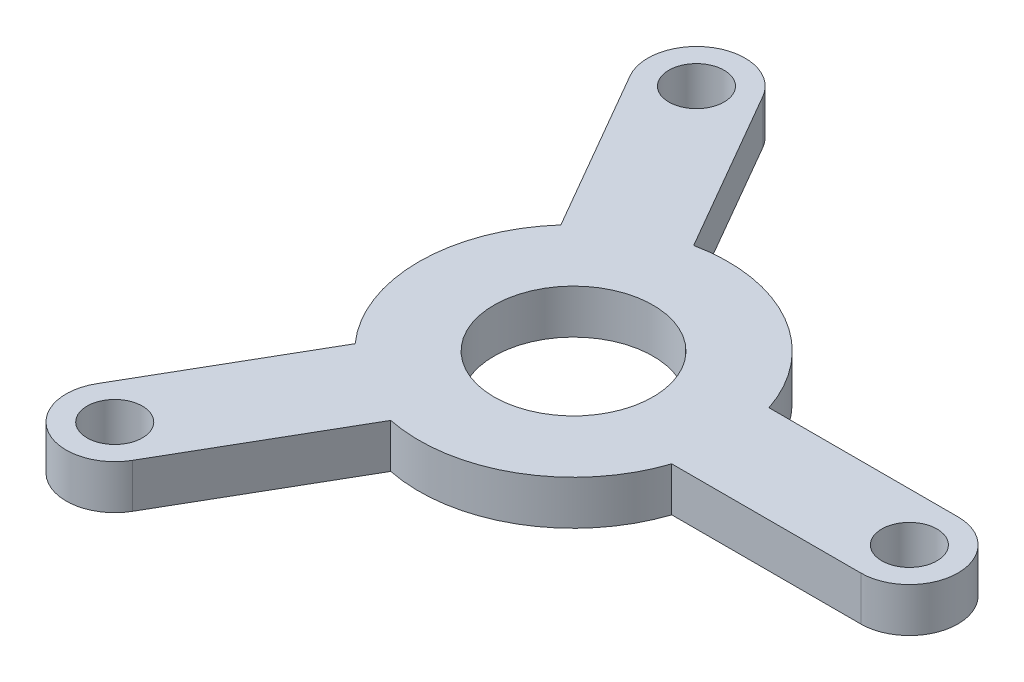
ISO-10303-21;
HEADER;
FILE_DESCRIPTION(('STEP AP214'),'2;1');
FILE_NAME('part.step','',(''),(''),'','','');
FILE_SCHEMA(('AUTOMOTIVE_DESIGN { 1 0 10303 214 1 1 1 1 }'));
ENDSEC;
DATA;
#1=APPLICATION_CONTEXT('core data for automotive mechanical design processes');
#2=APPLICATION_PROTOCOL_DEFINITION('international standard','automotive_design',2000,#1);
#3=PRODUCT_CONTEXT('',#1,'mechanical');
#4=PRODUCT('Part','Part','',(#3));
#5=PRODUCT_RELATED_PRODUCT_CATEGORY('part','',(#4));
#6=PRODUCT_DEFINITION_FORMATION('','',#4);
#7=PRODUCT_DEFINITION_CONTEXT('part definition',#1,'design');
#8=PRODUCT_DEFINITION('design','',#6,#7);
#9=PRODUCT_DEFINITION_SHAPE('','',#8);
#10=(LENGTH_UNIT() NAMED_UNIT(*) SI_UNIT(.MILLI.,.METRE.));
#11=(NAMED_UNIT(*) PLANE_ANGLE_UNIT() SI_UNIT($,.RADIAN.));
#12=(NAMED_UNIT(*) SI_UNIT($,.STERADIAN.) SOLID_ANGLE_UNIT());
#13=UNCERTAINTY_MEASURE_WITH_UNIT(LENGTH_MEASURE(1.E-05),#10,'distance_accuracy_value','');
#14=(GEOMETRIC_REPRESENTATION_CONTEXT(3) GLOBAL_UNCERTAINTY_ASSIGNED_CONTEXT((#13)) GLOBAL_UNIT_ASSIGNED_CONTEXT((#10,
#11,#12)) REPRESENTATION_CONTEXT('',''));
#15=CARTESIAN_POINT('',(0.,0.,0.));
#16=DIRECTION('',(0.,0.,1.));
#17=DIRECTION('',(1.,0.,0.));
#18=AXIS2_PLACEMENT_3D('',#15,#16,#17);
#19=CARTESIAN_POINT('',(0.,5.,0.));
#20=DIRECTION('',(0.,-1.,0.));
#21=DIRECTION('',(0.,0.,-1.));
#22=AXIS2_PLACEMENT_3D('',#19,#20,#21);
#23=CYLINDRICAL_SURFACE('',#22,17.5);
#24=DIRECTION('',(0.,-1.,0.));
#25=VECTOR('',#24,1.);
#26=CARTESIAN_POINT('',(-13.0697635837324,5.,11.6374945699383));
#27=LINE('',#26,#25);
#28=CARTESIAN_POINT('',(-13.0697635837324,5.,11.6374945699383));
#29=VERTEX_POINT('',#28);
#30=CARTESIAN_POINT('',(-13.0697635837324,0.,11.6374945699383));
#31=VERTEX_POINT('',#30);
#32=EDGE_CURVE('E158',#29,#31,#27,.T.);
#33=ORIENTED_EDGE('',*,*,#32,.F.);
#34=CARTESIAN_POINT('',(0.,5.,0.));
#35=DIRECTION('',(0.,1.,0.));
#36=DIRECTION('',(0.,0.,1.));
#37=AXIS2_PLACEMENT_3D('',#34,#35,#36);
#38=CIRCLE('',#37,17.5);
#39=CARTESIAN_POINT('',(-13.0697635837325,5.,-11.6374945699381));
#40=VERTEX_POINT('',#39);
#41=EDGE_CURVE('E129',#40,#29,#38,.T.);
#42=ORIENTED_EDGE('',*,*,#41,.F.);
#43=DIRECTION('',(0.,-1.,0.));
#44=VECTOR('',#43,1.);
#45=CARTESIAN_POINT('',(-13.0697635837325,5.,-11.6374945699381));
#46=LINE('',#45,#44);
#47=CARTESIAN_POINT('',(-13.0697635837325,0.,-11.6374945699381));
#48=VERTEX_POINT('',#47);
#49=EDGE_CURVE('E173',#40,#48,#46,.T.);
#50=ORIENTED_EDGE('',*,*,#49,.T.);
#51=CARTESIAN_POINT('',(0.,0.,0.));
#52=DIRECTION('',(0.,1.,0.));
#53=DIRECTION('',(0.,0.,1.));
#54=AXIS2_PLACEMENT_3D('',#51,#52,#53);
#55=CIRCLE('',#54,17.5);
#56=EDGE_CURVE('E222',#48,#31,#55,.T.);
#57=ORIENTED_EDGE('',*,*,#56,.T.);
#58=EDGE_LOOP('',(#33,#42,#50,#57));
#59=FACE_BOUND('',#58,.T.);
#60=ADVANCED_FACE('F37',(#59),#23,.T.);
#61=DIRECTION('',(0.,-1.,0.));
#62=VECTOR('',#61,1.);
#63=CARTESIAN_POINT('',(-3.54348414210373,5.,-17.1374945699381));
#64=LINE('',#63,#62);
#65=CARTESIAN_POINT('',(-3.54348414210373,5.,-17.1374945699381));
#66=VERTEX_POINT('',#65);
#67=CARTESIAN_POINT('',(-3.54348414210374,0.,-17.1374945699382));
#68=VERTEX_POINT('',#67);
#69=EDGE_CURVE('E181',#66,#68,#64,.T.);
#70=ORIENTED_EDGE('',*,*,#69,.F.);
#71=CARTESIAN_POINT('',(16.6132477258362,5.,-5.49999999999999));
#72=VERTEX_POINT('',#71);
#73=EDGE_CURVE('E216',#72,#66,#38,.T.);
#74=ORIENTED_EDGE('',*,*,#73,.F.);
#75=DIRECTION('',(0.,-1.,0.));
#76=VECTOR('',#75,1.);
#77=CARTESIAN_POINT('',(16.6132477258362,5.,-5.49999999999999));
#78=LINE('',#77,#76);
#79=CARTESIAN_POINT('',(16.6132477258362,0.,-5.49999999999999));
#80=VERTEX_POINT('',#79);
#81=EDGE_CURVE('E45',#72,#80,#78,.T.);
#82=ORIENTED_EDGE('',*,*,#81,.T.);
#83=EDGE_CURVE('E220',#80,#68,#55,.T.);
#84=ORIENTED_EDGE('',*,*,#83,.T.);
#85=EDGE_LOOP('',(#70,#74,#82,#84));
#86=FACE_BOUND('',#85,.T.);
#87=ADVANCED_FACE('F229',(#86),#23,.T.);
#88=CARTESIAN_POINT('',(-3.54348414210351,5.,17.1374945699382));
#89=VERTEX_POINT('',#88);
#90=CARTESIAN_POINT('',(16.6132477258361,5.,5.50000000000001));
#91=VERTEX_POINT('',#90);
#92=EDGE_CURVE('E219',#89,#91,#38,.T.);
#93=ORIENTED_EDGE('',*,*,#92,.F.);
#94=DIRECTION('',(0.,-1.,0.));
#95=VECTOR('',#94,1.);
#96=CARTESIAN_POINT('',(-3.54348414210351,5.,17.1374945699382));
#97=LINE('',#96,#95);
#98=CARTESIAN_POINT('',(-3.54348414210351,0.,17.1374945699382));
#99=VERTEX_POINT('',#98);
#100=EDGE_CURVE('E144',#89,#99,#97,.T.);
#101=ORIENTED_EDGE('',*,*,#100,.T.);
#102=CARTESIAN_POINT('',(16.6132477258361,0.,5.50000000000001));
#103=VERTEX_POINT('',#102);
#104=EDGE_CURVE('E213',#99,#103,#55,.T.);
#105=ORIENTED_EDGE('',*,*,#104,.T.);
#106=DIRECTION('',(0.,-1.,0.));
#107=VECTOR('',#106,1.);
#108=CARTESIAN_POINT('',(16.6132477258361,5.,5.50000000000001));
#109=LINE('',#108,#107);
#110=EDGE_CURVE('E11',#91,#103,#109,.T.);
#111=ORIENTED_EDGE('',*,*,#110,.F.);
#112=EDGE_LOOP('',(#93,#101,#105,#111));
#113=FACE_BOUND('',#112,.T.);
#114=ADVANCED_FACE('F39',(#113),#23,.T.);
#115=CARTESIAN_POINT('',(0.,5.,0.));
#116=DIRECTION('',(0.,1.,0.));
#117=DIRECTION('',(0.,0.,1.));
#118=AXIS2_PLACEMENT_3D('',#115,#116,#117);
#119=PLANE('',#118);
#120=CARTESIAN_POINT('',(-19.0000000000002,5.,-32.9089653438086));
#121=DIRECTION('',(0.,1.,0.));
#122=DIRECTION('',(0.,0.,1.));
#123=AXIS2_PLACEMENT_3D('',#120,#121,#122);
#124=CIRCLE('',#123,3.125);
#125=CARTESIAN_POINT('',(-19.0000000000002,5.,-29.7839653438086));
#126=VERTEX_POINT('',#125);
#127=EDGE_CURVE('E152',#126,#126,#124,.T.);
#128=ORIENTED_EDGE('',*,*,#127,.F.);
#129=EDGE_LOOP('',(#128));
#130=FACE_BOUND('',#129,.T.);
#131=CARTESIAN_POINT('',(-18.9999999999997,5.,32.9089653438088));
#132=DIRECTION('',(0.,1.,0.));
#133=DIRECTION('',(0.,0.,1.));
#134=AXIS2_PLACEMENT_3D('',#131,#132,#133);
#135=CIRCLE('',#134,3.125);
#136=CARTESIAN_POINT('',(-18.9999999999997,5.,36.0339653438088));
#137=VERTEX_POINT('',#136);
#138=EDGE_CURVE('E268',#137,#137,#135,.T.);
#139=ORIENTED_EDGE('',*,*,#138,.F.);
#140=EDGE_LOOP('',(#139));
#141=FACE_BOUND('',#140,.T.);
#142=ORIENTED_EDGE('',*,*,#41,.T.);
#143=DIRECTION('',(-0.499999999999992,0.,0.866025403784443));
#144=VECTOR('',#143,1.);
#145=CARTESIAN_POINT('',(-4.76313972081445,5.,-2.74999999999996));
#146=LINE('',#145,#144);
#147=CARTESIAN_POINT('',(-23.7631397208141,5.,30.1589653438089));
#148=VERTEX_POINT('',#147);
#149=EDGE_CURVE('E123',#29,#148,#146,.T.);
#150=ORIENTED_EDGE('',*,*,#149,.T.);
#151=CARTESIAN_POINT('',(-18.9999999999997,5.,32.9089653438088));
#152=DIRECTION('',(0.,1.,0.));
#153=DIRECTION('',(0.,0.,1.));
#154=AXIS2_PLACEMENT_3D('',#151,#152,#153);
#155=CIRCLE('',#154,5.5);
#156=CARTESIAN_POINT('',(-14.2368602791853,5.,35.6589653438088));
#157=VERTEX_POINT('',#156);
#158=EDGE_CURVE('E127',#148,#157,#155,.T.);
#159=ORIENTED_EDGE('',*,*,#158,.T.);
#160=DIRECTION('',(-0.499999999999992,0.,0.866025403784443));
#161=VECTOR('',#160,1.);
#162=CARTESIAN_POINT('',(4.76313972081443,5.,2.74999999999995));
#163=LINE('',#162,#161);
#164=EDGE_CURVE('E52',#89,#157,#163,.T.);
#165=ORIENTED_EDGE('',*,*,#164,.F.);
#166=ORIENTED_EDGE('',*,*,#92,.T.);
#167=DIRECTION('',(1.,0.,0.));
#168=VECTOR('',#167,1.);
#169=CARTESIAN_POINT('',(0.,5.,5.50000000000001));
#170=LINE('',#169,#168);
#171=CARTESIAN_POINT('',(38.,5.,5.5));
#172=VERTEX_POINT('',#171);
#173=EDGE_CURVE('E192',#91,#172,#170,.T.);
#174=ORIENTED_EDGE('',*,*,#173,.T.);
#175=CARTESIAN_POINT('',(38.,5.,0.));
#176=DIRECTION('',(0.,1.,0.));
#177=DIRECTION('',(0.,0.,1.));
#178=AXIS2_PLACEMENT_3D('',#175,#176,#177);
#179=CIRCLE('',#178,5.5);
#180=CARTESIAN_POINT('',(38.,5.,-5.5));
#181=VERTEX_POINT('',#180);
#182=EDGE_CURVE('E201',#172,#181,#179,.T.);
#183=ORIENTED_EDGE('',*,*,#182,.T.);
#184=DIRECTION('',(1.,0.,0.));
#185=VECTOR('',#184,1.);
#186=CARTESIAN_POINT('',(0.,5.,-5.49999999999999));
#187=LINE('',#186,#185);
#188=EDGE_CURVE('E197',#72,#181,#187,.T.);
#189=ORIENTED_EDGE('',*,*,#188,.F.);
#190=ORIENTED_EDGE('',*,*,#73,.T.);
#191=DIRECTION('',(-0.500000000000004,0.,-0.866025403784436));
#192=VECTOR('',#191,1.);
#193=CARTESIAN_POINT('',(4.76313972081441,5.,-2.75000000000003));
#194=LINE('',#193,#192);
#195=CARTESIAN_POINT('',(-14.2368602791858,5.,-35.6589653438086));
#196=VERTEX_POINT('',#195);
#197=EDGE_CURVE('E163',#66,#196,#194,.T.);
#198=ORIENTED_EDGE('',*,*,#197,.T.);
#199=CARTESIAN_POINT('',(-19.0000000000002,5.,-32.9089653438086));
#200=DIRECTION('',(0.,1.,0.));
#201=DIRECTION('',(0.,0.,1.));
#202=AXIS2_PLACEMENT_3D('',#199,#200,#201);
#203=CIRCLE('',#202,5.5);
#204=CARTESIAN_POINT('',(-23.7631397208146,5.,-30.1589653438086));
#205=VERTEX_POINT('',#204);
#206=EDGE_CURVE('E171',#196,#205,#203,.T.);
#207=ORIENTED_EDGE('',*,*,#206,.T.);
#208=DIRECTION('',(-0.500000000000004,0.,-0.866025403784436));
#209=VECTOR('',#208,1.);
#210=CARTESIAN_POINT('',(-4.76313972081439,5.,2.75000000000002));
#211=LINE('',#210,#209);
#212=EDGE_CURVE('E59',#40,#205,#211,.T.);
#213=ORIENTED_EDGE('',*,*,#212,.F.);
#214=EDGE_LOOP('',(#142,#150,#159,#165,#166,#174,#183,#189,#190,#198,#207,#213));
#215=FACE_BOUND('',#214,.T.);
#216=CARTESIAN_POINT('',(38.,5.,0.));
#217=DIRECTION('',(0.,1.,0.));
#218=DIRECTION('',(0.,0.,1.));
#219=AXIS2_PLACEMENT_3D('',#216,#217,#218);
#220=CIRCLE('',#219,3.125);
#221=CARTESIAN_POINT('',(38.,5.,3.125));
#222=VERTEX_POINT('',#221);
#223=EDGE_CURVE('E186',#222,#222,#220,.T.);
#224=ORIENTED_EDGE('',*,*,#223,.F.);
#225=EDGE_LOOP('',(#224));
#226=FACE_BOUND('',#225,.T.);
#227=CARTESIAN_POINT('',(0.,5.,0.));
#228=DIRECTION('',(0.,1.,0.));
#229=DIRECTION('',(0.,0.,1.));
#230=AXIS2_PLACEMENT_3D('',#227,#228,#229);
#231=CIRCLE('',#230,9.);
#232=CARTESIAN_POINT('',(0.,5.,9.));
#233=VERTEX_POINT('',#232);
#234=EDGE_CURVE('E210',#233,#233,#231,.T.);
#235=ORIENTED_EDGE('',*,*,#234,.F.);
#236=EDGE_LOOP('',(#235));
#237=FACE_BOUND('',#236,.T.);
#238=ADVANCED_FACE('F125',(#130,#141,#215,#226,#237),#119,.T.);
#239=CARTESIAN_POINT('',(0.,0.,0.));
#240=DIRECTION('',(0.,1.,0.));
#241=DIRECTION('',(0.,0.,1.));
#242=AXIS2_PLACEMENT_3D('',#239,#240,#241);
#243=PLANE('',#242);
#244=CARTESIAN_POINT('',(-19.0000000000002,0.,-32.9089653438086));
#245=DIRECTION('',(0.,1.,0.));
#246=DIRECTION('',(0.866025403784436,0.,-0.500000000000004));
#247=AXIS2_PLACEMENT_3D('',#244,#245,#246);
#248=CIRCLE('',#247,3.125);
#249=CARTESIAN_POINT('',(-16.2936706131738,0.,-34.4714653438086));
#250=VERTEX_POINT('',#249);
#251=EDGE_CURVE('E271',#250,#250,#248,.T.);
#252=ORIENTED_EDGE('',*,*,#251,.T.);
#253=EDGE_LOOP('',(#252));
#254=FACE_BOUND('',#253,.T.);
#255=CARTESIAN_POINT('',(-18.9999999999997,0.,32.9089653438088));
#256=DIRECTION('',(0.,1.,0.));
#257=DIRECTION('',(-0.866025403784443,0.,-0.499999999999992));
#258=AXIS2_PLACEMENT_3D('',#255,#256,#257);
#259=CIRCLE('',#258,3.125);
#260=CARTESIAN_POINT('',(-21.7063293868261,0.,31.3464653438089));
#261=VERTEX_POINT('',#260);
#262=EDGE_CURVE('E272',#261,#261,#259,.T.);
#263=ORIENTED_EDGE('',*,*,#262,.T.);
#264=EDGE_LOOP('',(#263));
#265=FACE_BOUND('',#264,.T.);
#266=ORIENTED_EDGE('',*,*,#104,.F.);
#267=DIRECTION('',(-0.499999999999992,0.,0.866025403784443));
#268=VECTOR('',#267,1.);
#269=CARTESIAN_POINT('',(4.76313972081443,0.,2.74999999999995));
#270=LINE('',#269,#268);
#271=CARTESIAN_POINT('',(-14.2368602791853,0.,35.6589653438088));
#272=VERTEX_POINT('',#271);
#273=EDGE_CURVE('E133',#99,#272,#270,.T.);
#274=ORIENTED_EDGE('',*,*,#273,.T.);
#275=CARTESIAN_POINT('',(-18.9999999999997,0.,32.9089653438088));
#276=DIRECTION('',(0.,1.,0.));
#277=DIRECTION('',(-0.866025403784443,0.,-0.499999999999992));
#278=AXIS2_PLACEMENT_3D('',#275,#276,#277);
#279=CIRCLE('',#278,5.5);
#280=CARTESIAN_POINT('',(-23.7631397208141,0.,30.1589653438089));
#281=VERTEX_POINT('',#280);
#282=EDGE_CURVE('E149',#281,#272,#279,.T.);
#283=ORIENTED_EDGE('',*,*,#282,.F.);
#284=DIRECTION('',(-0.499999999999992,0.,0.866025403784443));
#285=VECTOR('',#284,1.);
#286=CARTESIAN_POINT('',(-4.76313972081445,0.,-2.74999999999996));
#287=LINE('',#286,#285);
#288=EDGE_CURVE('E148',#31,#281,#287,.T.);
#289=ORIENTED_EDGE('',*,*,#288,.F.);
#290=ORIENTED_EDGE('',*,*,#56,.F.);
#291=DIRECTION('',(-0.500000000000004,0.,-0.866025403784436));
#292=VECTOR('',#291,1.);
#293=CARTESIAN_POINT('',(-4.76313972081439,0.,2.75000000000002));
#294=LINE('',#293,#292);
#295=CARTESIAN_POINT('',(-23.7631397208146,0.,-30.1589653438086));
#296=VERTEX_POINT('',#295);
#297=EDGE_CURVE('E161',#48,#296,#294,.T.);
#298=ORIENTED_EDGE('',*,*,#297,.T.);
#299=CARTESIAN_POINT('',(-19.0000000000002,0.,-32.9089653438086));
#300=DIRECTION('',(0.,1.,0.));
#301=DIRECTION('',(0.866025403784436,0.,-0.500000000000004));
#302=AXIS2_PLACEMENT_3D('',#299,#300,#301);
#303=CIRCLE('',#302,5.5);
#304=CARTESIAN_POINT('',(-14.2368602791858,0.,-35.6589653438086));
#305=VERTEX_POINT('',#304);
#306=EDGE_CURVE('E165',#305,#296,#303,.T.);
#307=ORIENTED_EDGE('',*,*,#306,.F.);
#308=DIRECTION('',(-0.500000000000004,0.,-0.866025403784436));
#309=VECTOR('',#308,1.);
#310=CARTESIAN_POINT('',(4.76313972081441,0.,-2.75000000000003));
#311=LINE('',#310,#309);
#312=EDGE_CURVE('E160',#68,#305,#311,.T.);
#313=ORIENTED_EDGE('',*,*,#312,.F.);
#314=ORIENTED_EDGE('',*,*,#83,.F.);
#315=DIRECTION('',(1.,0.,0.));
#316=VECTOR('',#315,1.);
#317=CARTESIAN_POINT('',(0.,0.,-5.49999999999999));
#318=LINE('',#317,#316);
#319=CARTESIAN_POINT('',(38.,0.,-5.5));
#320=VERTEX_POINT('',#319);
#321=EDGE_CURVE('E190',#80,#320,#318,.T.);
#322=ORIENTED_EDGE('',*,*,#321,.T.);
#323=CARTESIAN_POINT('',(38.,0.,0.));
#324=DIRECTION('',(0.,1.,0.));
#325=DIRECTION('',(0.,0.,1.));
#326=AXIS2_PLACEMENT_3D('',#323,#324,#325);
#327=CIRCLE('',#326,5.5);
#328=CARTESIAN_POINT('',(38.,0.,5.5));
#329=VERTEX_POINT('',#328);
#330=EDGE_CURVE('E194',#329,#320,#327,.T.);
#331=ORIENTED_EDGE('',*,*,#330,.F.);
#332=DIRECTION('',(1.,0.,0.));
#333=VECTOR('',#332,1.);
#334=CARTESIAN_POINT('',(0.,0.,5.50000000000001));
#335=LINE('',#334,#333);
#336=EDGE_CURVE('E189',#103,#329,#335,.T.);
#337=ORIENTED_EDGE('',*,*,#336,.F.);
#338=EDGE_LOOP('',(#266,#274,#283,#289,#290,#298,#307,#313,#314,#322,#331,#337));
#339=FACE_BOUND('',#338,.T.);
#340=CARTESIAN_POINT('',(38.,0.,0.));
#341=DIRECTION('',(0.,1.,0.));
#342=DIRECTION('',(0.,0.,1.));
#343=AXIS2_PLACEMENT_3D('',#340,#341,#342);
#344=CIRCLE('',#343,3.125);
#345=CARTESIAN_POINT('',(38.,0.,3.125));
#346=VERTEX_POINT('',#345);
#347=EDGE_CURVE('E183',#346,#346,#344,.T.);
#348=ORIENTED_EDGE('',*,*,#347,.T.);
#349=EDGE_LOOP('',(#348));
#350=FACE_BOUND('',#349,.T.);
#351=CARTESIAN_POINT('',(0.,0.,0.));
#352=DIRECTION('',(0.,1.,0.));
#353=DIRECTION('',(0.,0.,1.));
#354=AXIS2_PLACEMENT_3D('',#351,#352,#353);
#355=CIRCLE('',#354,9.);
#356=CARTESIAN_POINT('',(0.,0.,9.));
#357=VERTEX_POINT('',#356);
#358=EDGE_CURVE('E204',#357,#357,#355,.T.);
#359=ORIENTED_EDGE('',*,*,#358,.T.);
#360=EDGE_LOOP('',(#359));
#361=FACE_BOUND('',#360,.T.);
#362=ADVANCED_FACE('F234',(#254,#265,#339,#350,#361),#243,.F.);
#363=CARTESIAN_POINT('',(0.,5.,0.));
#364=DIRECTION('',(0.,-1.,0.));
#365=DIRECTION('',(0.,0.,-1.));
#366=AXIS2_PLACEMENT_3D('',#363,#364,#365);
#367=CYLINDRICAL_SURFACE('',#366,9.);
#368=ORIENTED_EDGE('',*,*,#234,.T.);
#369=EDGE_LOOP('',(#368));
#370=FACE_BOUND('',#369,.T.);
#371=ORIENTED_EDGE('',*,*,#358,.F.);
#372=EDGE_LOOP('',(#371));
#373=FACE_BOUND('',#372,.T.);
#374=ADVANCED_FACE('F303',(#370,#373),#367,.F.);
#375=CARTESIAN_POINT('',(0.,40.2503387094491,5.50000000000001));
#376=DIRECTION('',(0.,0.,-1.));
#377=DIRECTION('',(-1.,0.,0.));
#378=AXIS2_PLACEMENT_3D('',#375,#376,#377);
#379=PLANE('',#378);
#380=ORIENTED_EDGE('',*,*,#173,.F.);
#381=ORIENTED_EDGE('',*,*,#110,.T.);
#382=ORIENTED_EDGE('',*,*,#336,.T.);
#383=DIRECTION('',(0.,-1.,0.));
#384=VECTOR('',#383,1.);
#385=CARTESIAN_POINT('',(38.,40.2503387094491,5.5));
#386=LINE('',#385,#384);
#387=EDGE_CURVE('E198',#172,#329,#386,.T.);
#388=ORIENTED_EDGE('',*,*,#387,.F.);
#389=EDGE_LOOP('',(#380,#381,#382,#388));
#390=FACE_BOUND('',#389,.T.);
#391=ADVANCED_FACE('F254',(#390),#379,.F.);
#392=CARTESIAN_POINT('',(0.,40.2503387094491,-5.49999999999999));
#393=DIRECTION('',(0.,0.,-1.));
#394=DIRECTION('',(-1.,0.,0.));
#395=AXIS2_PLACEMENT_3D('',#392,#393,#394);
#396=PLANE('',#395);
#397=ORIENTED_EDGE('',*,*,#81,.F.);
#398=ORIENTED_EDGE('',*,*,#188,.T.);
#399=DIRECTION('',(0.,-1.,0.));
#400=VECTOR('',#399,1.);
#401=CARTESIAN_POINT('',(38.,40.2503387094491,-5.5));
#402=LINE('',#401,#400);
#403=EDGE_CURVE('E193',#181,#320,#402,.T.);
#404=ORIENTED_EDGE('',*,*,#403,.T.);
#405=ORIENTED_EDGE('',*,*,#321,.F.);
#406=EDGE_LOOP('',(#397,#398,#404,#405));
#407=FACE_BOUND('',#406,.T.);
#408=ADVANCED_FACE('F247',(#407),#396,.T.);
#409=CARTESIAN_POINT('',(38.,40.2503387094491,0.));
#410=DIRECTION('',(0.,-1.,0.));
#411=DIRECTION('',(0.,0.,-1.));
#412=AXIS2_PLACEMENT_3D('',#409,#410,#411);
#413=CYLINDRICAL_SURFACE('',#412,5.5);
#414=ORIENTED_EDGE('',*,*,#182,.F.);
#415=ORIENTED_EDGE('',*,*,#387,.T.);
#416=ORIENTED_EDGE('',*,*,#330,.T.);
#417=ORIENTED_EDGE('',*,*,#403,.F.);
#418=EDGE_LOOP('',(#414,#415,#416,#417));
#419=FACE_BOUND('',#418,.T.);
#420=ADVANCED_FACE('F249',(#419),#413,.T.);
#421=CARTESIAN_POINT('',(38.,0.,0.));
#422=DIRECTION('',(0.,1.,0.));
#423=DIRECTION('',(0.,0.,1.));
#424=AXIS2_PLACEMENT_3D('',#421,#422,#423);
#425=CYLINDRICAL_SURFACE('',#424,3.125);
#426=ORIENTED_EDGE('',*,*,#223,.T.);
#427=EDGE_LOOP('',(#426));
#428=FACE_BOUND('',#427,.T.);
#429=ORIENTED_EDGE('',*,*,#347,.F.);
#430=EDGE_LOOP('',(#429));
#431=FACE_BOUND('',#430,.T.);
#432=ADVANCED_FACE('F314',(#428,#431),#425,.F.);
#433=CARTESIAN_POINT('',(4.76313972081441,45.5471122239729,-2.75000000000003));
#434=DIRECTION('',(-0.866025403784436,0.,0.500000000000004));
#435=DIRECTION('',(0.500000000000004,0.,0.866025403784436));
#436=AXIS2_PLACEMENT_3D('',#433,#434,#435);
#437=PLANE('',#436);
#438=ORIENTED_EDGE('',*,*,#197,.F.);
#439=ORIENTED_EDGE('',*,*,#69,.T.);
#440=ORIENTED_EDGE('',*,*,#312,.T.);
#441=DIRECTION('',(0.,-1.,0.));
#442=VECTOR('',#441,1.);
#443=CARTESIAN_POINT('',(-14.2368602791858,45.5471122239729,-35.6589653438086));
#444=LINE('',#443,#442);
#445=EDGE_CURVE('E168',#196,#305,#444,.T.);
#446=ORIENTED_EDGE('',*,*,#445,.F.);
#447=EDGE_LOOP('',(#438,#439,#440,#446));
#448=FACE_BOUND('',#447,.T.);
#449=ADVANCED_FACE('F240',(#448),#437,.F.);
#450=CARTESIAN_POINT('',(-4.76313972081439,45.5471122239729,2.75000000000002));
#451=DIRECTION('',(-0.866025403784436,0.,0.500000000000004));
#452=DIRECTION('',(0.500000000000004,0.,0.866025403784436));
#453=AXIS2_PLACEMENT_3D('',#450,#451,#452);
#454=PLANE('',#453);
#455=ORIENTED_EDGE('',*,*,#49,.F.);
#456=ORIENTED_EDGE('',*,*,#212,.T.);
#457=DIRECTION('',(0.,-1.,0.));
#458=VECTOR('',#457,1.);
#459=CARTESIAN_POINT('',(-23.7631397208146,45.5471122239729,-30.1589653438086));
#460=LINE('',#459,#458);
#461=EDGE_CURVE('E164',#205,#296,#460,.T.);
#462=ORIENTED_EDGE('',*,*,#461,.T.);
#463=ORIENTED_EDGE('',*,*,#297,.F.);
#464=EDGE_LOOP('',(#455,#456,#462,#463));
#465=FACE_BOUND('',#464,.T.);
#466=ADVANCED_FACE('F322',(#465),#454,.T.);
#467=CARTESIAN_POINT('',(-19.0000000000002,45.5471122239729,-32.9089653438086));
#468=DIRECTION('',(0.,-1.,0.));
#469=DIRECTION('',(0.,0.,-1.));
#470=AXIS2_PLACEMENT_3D('',#467,#468,#469);
#471=CYLINDRICAL_SURFACE('',#470,5.5);
#472=ORIENTED_EDGE('',*,*,#206,.F.);
#473=ORIENTED_EDGE('',*,*,#445,.T.);
#474=ORIENTED_EDGE('',*,*,#306,.T.);
#475=ORIENTED_EDGE('',*,*,#461,.F.);
#476=EDGE_LOOP('',(#472,#473,#474,#475));
#477=FACE_BOUND('',#476,.T.);
#478=ADVANCED_FACE('F243',(#477),#471,.T.);
#479=CARTESIAN_POINT('',(-4.76313972081445,45.5471122239728,-2.74999999999996));
#480=DIRECTION('',(0.866025403784444,0.,0.499999999999992));
#481=DIRECTION('',(0.499999999999992,0.,-0.866025403784443));
#482=AXIS2_PLACEMENT_3D('',#479,#480,#481);
#483=PLANE('',#482);
#484=ORIENTED_EDGE('',*,*,#149,.F.);
#485=ORIENTED_EDGE('',*,*,#32,.T.);
#486=ORIENTED_EDGE('',*,*,#288,.T.);
#487=DIRECTION('',(0.,-1.,0.));
#488=VECTOR('',#487,1.);
#489=CARTESIAN_POINT('',(-23.7631397208141,45.5471122239728,30.1589653438089));
#490=LINE('',#489,#488);
#491=EDGE_CURVE('E140',#148,#281,#490,.T.);
#492=ORIENTED_EDGE('',*,*,#491,.F.);
#493=EDGE_LOOP('',(#484,#485,#486,#492));
#494=FACE_BOUND('',#493,.T.);
#495=ADVANCED_FACE('F146',(#494),#483,.F.);
#496=CARTESIAN_POINT('',(4.76313972081443,45.5471122239728,2.74999999999995));
#497=DIRECTION('',(0.866025403784444,0.,0.499999999999992));
#498=DIRECTION('',(0.499999999999992,0.,-0.866025403784443));
#499=AXIS2_PLACEMENT_3D('',#496,#497,#498);
#500=PLANE('',#499);
#501=ORIENTED_EDGE('',*,*,#100,.F.);
#502=ORIENTED_EDGE('',*,*,#164,.T.);
#503=DIRECTION('',(0.,-1.,0.));
#504=VECTOR('',#503,1.);
#505=CARTESIAN_POINT('',(-14.2368602791853,45.5471122239728,35.6589653438088));
#506=LINE('',#505,#504);
#507=EDGE_CURVE('E143',#157,#272,#506,.T.);
#508=ORIENTED_EDGE('',*,*,#507,.T.);
#509=ORIENTED_EDGE('',*,*,#273,.F.);
#510=EDGE_LOOP('',(#501,#502,#508,#509));
#511=FACE_BOUND('',#510,.T.);
#512=ADVANCED_FACE('F263',(#511),#500,.T.);
#513=CARTESIAN_POINT('',(-18.9999999999997,45.5471122239728,32.9089653438088));
#514=DIRECTION('',(0.,-1.,0.));
#515=DIRECTION('',(0.,0.,-1.));
#516=AXIS2_PLACEMENT_3D('',#513,#514,#515);
#517=CYLINDRICAL_SURFACE('',#516,5.5);
#518=ORIENTED_EDGE('',*,*,#158,.F.);
#519=ORIENTED_EDGE('',*,*,#491,.T.);
#520=ORIENTED_EDGE('',*,*,#282,.T.);
#521=ORIENTED_EDGE('',*,*,#507,.F.);
#522=EDGE_LOOP('',(#518,#519,#520,#521));
#523=FACE_BOUND('',#522,.T.);
#524=ADVANCED_FACE('F138',(#523),#517,.T.);
#525=CARTESIAN_POINT('',(-18.9999999999997,0.,32.9089653438088));
#526=DIRECTION('',(0.,1.,0.));
#527=DIRECTION('',(0.,0.,1.));
#528=AXIS2_PLACEMENT_3D('',#525,#526,#527);
#529=CYLINDRICAL_SURFACE('',#528,3.125);
#530=ORIENTED_EDGE('',*,*,#138,.T.);
#531=EDGE_LOOP('',(#530));
#532=FACE_BOUND('',#531,.T.);
#533=ORIENTED_EDGE('',*,*,#262,.F.);
#534=EDGE_LOOP('',(#533));
#535=FACE_BOUND('',#534,.T.);
#536=ADVANCED_FACE('F282',(#532,#535),#529,.F.);
#537=CARTESIAN_POINT('',(-19.0000000000002,0.,-32.9089653438086));
#538=DIRECTION('',(0.,1.,0.));
#539=DIRECTION('',(0.,0.,1.));
#540=AXIS2_PLACEMENT_3D('',#537,#538,#539);
#541=CYLINDRICAL_SURFACE('',#540,3.125);
#542=ORIENTED_EDGE('',*,*,#127,.T.);
#543=EDGE_LOOP('',(#542));
#544=FACE_BOUND('',#543,.T.);
#545=ORIENTED_EDGE('',*,*,#251,.F.);
#546=EDGE_LOOP('',(#545));
#547=FACE_BOUND('',#546,.T.);
#548=ADVANCED_FACE('F280',(#544,#547),#541,.F.);
#549=CLOSED_SHELL('',(#60,#87,#114,#238,#362,#374,#391,#408,#420,#432,#449,#466,#478,#495,#512,
#524,#536,#548));
#550=MANIFOLD_SOLID_BREP('B2',#549);
#551=ADVANCED_BREP_SHAPE_REPRESENTATION('',(#18,#550),#14);
#552=SHAPE_DEFINITION_REPRESENTATION(#9,#551);
ENDSEC;
END-ISO-10303-21;
